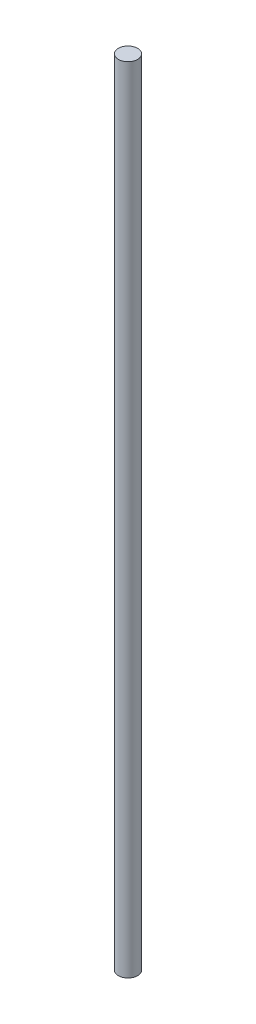
ISO-10303-21;
HEADER;
FILE_DESCRIPTION(('STEP AP214'),'2;1');
FILE_NAME('part.step','',(''),(''),'','','');
FILE_SCHEMA(('AUTOMOTIVE_DESIGN { 1 0 10303 214 1 1 1 1 }'));
ENDSEC;
DATA;
#1=APPLICATION_CONTEXT('core data for automotive mechanical design processes');
#2=APPLICATION_PROTOCOL_DEFINITION('international standard','automotive_design',2000,#1);
#3=PRODUCT_CONTEXT('',#1,'mechanical');
#4=PRODUCT('Part','Part','',(#3));
#5=PRODUCT_RELATED_PRODUCT_CATEGORY('part','',(#4));
#6=PRODUCT_DEFINITION_FORMATION('','',#4);
#7=PRODUCT_DEFINITION_CONTEXT('part definition',#1,'design');
#8=PRODUCT_DEFINITION('design','',#6,#7);
#9=PRODUCT_DEFINITION_SHAPE('','',#8);
#10=(LENGTH_UNIT() NAMED_UNIT(*) SI_UNIT(.MILLI.,.METRE.));
#11=(NAMED_UNIT(*) PLANE_ANGLE_UNIT() SI_UNIT($,.RADIAN.));
#12=(NAMED_UNIT(*) SI_UNIT($,.STERADIAN.) SOLID_ANGLE_UNIT());
#13=UNCERTAINTY_MEASURE_WITH_UNIT(LENGTH_MEASURE(1.E-05),#10,'distance_accuracy_value','');
#14=(GEOMETRIC_REPRESENTATION_CONTEXT(3) GLOBAL_UNCERTAINTY_ASSIGNED_CONTEXT((#13)) GLOBAL_UNIT_ASSIGNED_CONTEXT((#10,
#11,#12)) REPRESENTATION_CONTEXT('',''));
#15=CARTESIAN_POINT('',(0.,0.,0.));
#16=DIRECTION('',(0.,0.,1.));
#17=DIRECTION('',(1.,0.,0.));
#18=AXIS2_PLACEMENT_3D('',#15,#16,#17);
#19=CARTESIAN_POINT('',(0.,330.,0.));
#20=DIRECTION('',(0.,-1.,0.));
#21=DIRECTION('',(0.,0.,-1.));
#22=AXIS2_PLACEMENT_3D('',#19,#20,#21);
#23=CYLINDRICAL_SURFACE('',#22,4.);
#24=CARTESIAN_POINT('',(0.,330.,0.));
#25=DIRECTION('',(0.,1.,0.));
#26=DIRECTION('',(0.,0.,1.));
#27=AXIS2_PLACEMENT_3D('',#24,#25,#26);
#28=CIRCLE('',#27,4.);
#29=CARTESIAN_POINT('',(0.,330.,4.));
#30=VERTEX_POINT('',#29);
#31=EDGE_CURVE('E10',#30,#30,#28,.T.);
#32=ORIENTED_EDGE('',*,*,#31,.F.);
#33=EDGE_LOOP('',(#32));
#34=FACE_BOUND('',#33,.T.);
#35=CARTESIAN_POINT('',(0.,0.,0.));
#36=DIRECTION('',(0.,1.,0.));
#37=DIRECTION('',(0.,0.,1.));
#38=AXIS2_PLACEMENT_3D('',#35,#36,#37);
#39=CIRCLE('',#38,4.);
#40=CARTESIAN_POINT('',(0.,0.,4.));
#41=VERTEX_POINT('',#40);
#42=EDGE_CURVE('E34',#41,#41,#39,.T.);
#43=ORIENTED_EDGE('',*,*,#42,.T.);
#44=EDGE_LOOP('',(#43));
#45=FACE_BOUND('',#44,.T.);
#46=ADVANCED_FACE('F31',(#34,#45),#23,.T.);
#47=CARTESIAN_POINT('',(0.,330.,0.));
#48=DIRECTION('',(0.,1.,0.));
#49=DIRECTION('',(0.,0.,1.));
#50=AXIS2_PLACEMENT_3D('',#47,#48,#49);
#51=PLANE('',#50);
#52=ORIENTED_EDGE('',*,*,#31,.T.);
#53=EDGE_LOOP('',(#52));
#54=FACE_BOUND('',#53,.T.);
#55=ADVANCED_FACE('F46',(#54),#51,.T.);
#56=CARTESIAN_POINT('',(0.,0.,0.));
#57=DIRECTION('',(0.,1.,0.));
#58=DIRECTION('',(0.,0.,1.));
#59=AXIS2_PLACEMENT_3D('',#56,#57,#58);
#60=PLANE('',#59);
#61=ORIENTED_EDGE('',*,*,#42,.F.);
#62=EDGE_LOOP('',(#61));
#63=FACE_BOUND('',#62,.T.);
#64=ADVANCED_FACE('F44',(#63),#60,.F.);
#65=CLOSED_SHELL('',(#46,#55,#64));
#66=MANIFOLD_SOLID_BREP('B2',#65);
#67=ADVANCED_BREP_SHAPE_REPRESENTATION('',(#18,#66),#14);
#68=SHAPE_DEFINITION_REPRESENTATION(#9,#67);
ENDSEC;
END-ISO-10303-21;
